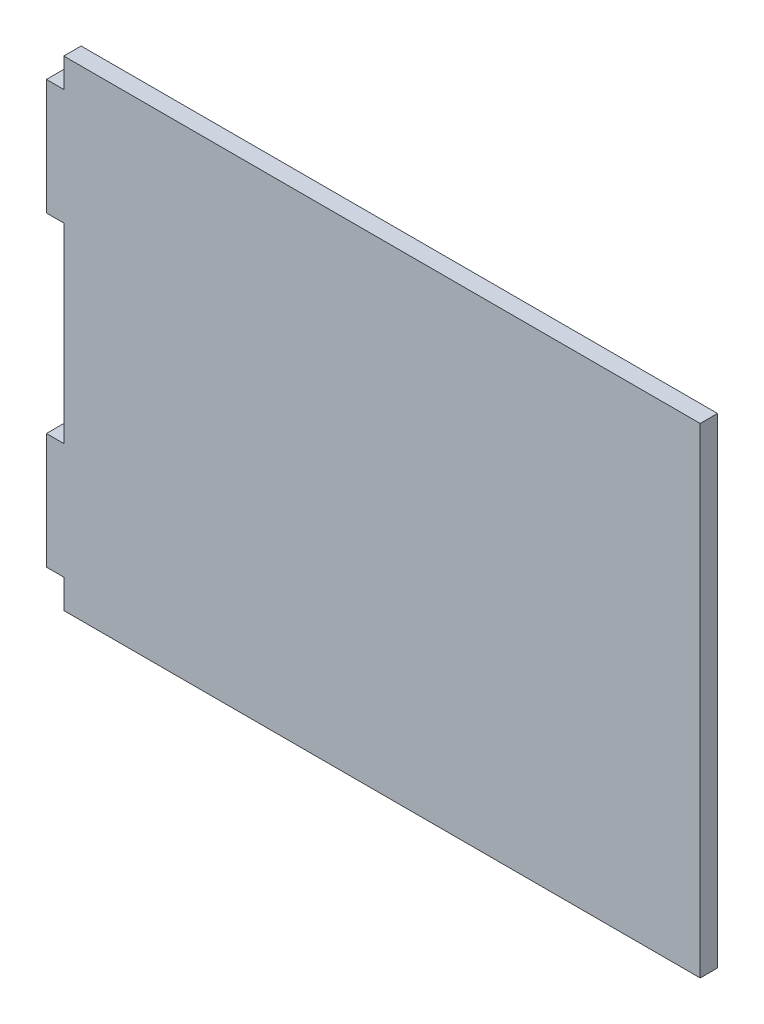
ISO-10303-21;
HEADER;
FILE_DESCRIPTION(('STEP AP214'),'2;1');
FILE_NAME('part.step','',(''),(''),'','','');
FILE_SCHEMA(('AUTOMOTIVE_DESIGN { 1 0 10303 214 1 1 1 1 }'));
ENDSEC;
DATA;
#1=APPLICATION_CONTEXT('core data for automotive mechanical design processes');
#2=APPLICATION_PROTOCOL_DEFINITION('international standard','automotive_design',2000,#1);
#3=PRODUCT_CONTEXT('',#1,'mechanical');
#4=PRODUCT('Part','Part','',(#3));
#5=PRODUCT_RELATED_PRODUCT_CATEGORY('part','',(#4));
#6=PRODUCT_DEFINITION_FORMATION('','',#4);
#7=PRODUCT_DEFINITION_CONTEXT('part definition',#1,'design');
#8=PRODUCT_DEFINITION('design','',#6,#7);
#9=PRODUCT_DEFINITION_SHAPE('','',#8);
#10=(LENGTH_UNIT() NAMED_UNIT(*) SI_UNIT(.MILLI.,.METRE.));
#11=(NAMED_UNIT(*) PLANE_ANGLE_UNIT() SI_UNIT($,.RADIAN.));
#12=(NAMED_UNIT(*) SI_UNIT($,.STERADIAN.) SOLID_ANGLE_UNIT());
#13=UNCERTAINTY_MEASURE_WITH_UNIT(LENGTH_MEASURE(1.E-05),#10,'distance_accuracy_value','');
#14=(GEOMETRIC_REPRESENTATION_CONTEXT(3) GLOBAL_UNCERTAINTY_ASSIGNED_CONTEXT((#13)) GLOBAL_UNIT_ASSIGNED_CONTEXT((#10,
#11,#12)) REPRESENTATION_CONTEXT('',''));
#15=CARTESIAN_POINT('',(0.,0.,0.));
#16=DIRECTION('',(0.,0.,1.));
#17=DIRECTION('',(1.,0.,0.));
#18=AXIS2_PLACEMENT_3D('',#15,#16,#17);
#19=CARTESIAN_POINT('',(-55.3612060704944,32.239336492891,3.));
#20=DIRECTION('',(1.,0.,0.));
#21=DIRECTION('',(0.,0.,-1.));
#22=AXIS2_PLACEMENT_3D('',#19,#20,#21);
#23=PLANE('',#22);
#24=DIRECTION('',(0.,-1.,0.));
#25=VECTOR('',#24,1.);
#26=CARTESIAN_POINT('',(-55.3612060704944,32.239336492891,0.));
#27=LINE('',#26,#25);
#28=CARTESIAN_POINT('',(-55.3612060704944,32.239336492891,0.));
#29=VERTEX_POINT('',#28);
#30=CARTESIAN_POINT('',(-55.3612060704944,27.239336492891,0.));
#31=VERTEX_POINT('',#30);
#32=EDGE_CURVE('E153',#29,#31,#27,.T.);
#33=ORIENTED_EDGE('',*,*,#32,.T.);
#34=DIRECTION('',(0.,0.,-1.));
#35=VECTOR('',#34,1.);
#36=CARTESIAN_POINT('',(-55.3612060704944,27.239336492891,3.));
#37=LINE('',#36,#35);
#38=CARTESIAN_POINT('',(-55.3612060704944,27.239336492891,3.));
#39=VERTEX_POINT('',#38);
#40=EDGE_CURVE('E11',#39,#31,#37,.T.);
#41=ORIENTED_EDGE('',*,*,#40,.F.);
#42=DIRECTION('',(0.,-1.,0.));
#43=VECTOR('',#42,1.);
#44=CARTESIAN_POINT('',(-55.3612060704944,32.239336492891,3.));
#45=LINE('',#44,#43);
#46=CARTESIAN_POINT('',(-55.3612060704944,32.239336492891,3.));
#47=VERTEX_POINT('',#46);
#48=EDGE_CURVE('E175',#47,#39,#45,.T.);
#49=ORIENTED_EDGE('',*,*,#48,.F.);
#50=DIRECTION('',(0.,0.,-1.));
#51=VECTOR('',#50,1.);
#52=CARTESIAN_POINT('',(-55.3612060704944,32.239336492891,3.));
#53=LINE('',#52,#51);
#54=EDGE_CURVE('E149',#47,#29,#53,.T.);
#55=ORIENTED_EDGE('',*,*,#54,.T.);
#56=EDGE_LOOP('',(#33,#41,#49,#55));
#57=FACE_BOUND('',#56,.T.);
#58=ADVANCED_FACE('F33',(#57),#23,.F.);
#59=CARTESIAN_POINT('',(-55.3612060704944,27.239336492891,3.));
#60=DIRECTION('',(0.,-1.,0.));
#61=DIRECTION('',(0.,0.,-1.));
#62=AXIS2_PLACEMENT_3D('',#59,#60,#61);
#63=PLANE('',#62);
#64=DIRECTION('',(-1.,0.,0.));
#65=VECTOR('',#64,1.);
#66=CARTESIAN_POINT('',(-55.3612060704944,27.239336492891,0.));
#67=LINE('',#66,#65);
#68=CARTESIAN_POINT('',(-58.3612060704944,27.239336492891,0.));
#69=VERTEX_POINT('',#68);
#70=EDGE_CURVE('E156',#31,#69,#67,.T.);
#71=ORIENTED_EDGE('',*,*,#70,.T.);
#72=DIRECTION('',(0.,0.,-1.));
#73=VECTOR('',#72,1.);
#74=CARTESIAN_POINT('',(-58.3612060704944,27.239336492891,3.));
#75=LINE('',#74,#73);
#76=CARTESIAN_POINT('',(-58.3612060704944,27.239336492891,3.));
#77=VERTEX_POINT('',#76);
#78=EDGE_CURVE('E41',#77,#69,#75,.T.);
#79=ORIENTED_EDGE('',*,*,#78,.F.);
#80=DIRECTION('',(-1.,0.,0.));
#81=VECTOR('',#80,1.);
#82=CARTESIAN_POINT('',(-55.3612060704944,27.239336492891,3.));
#83=LINE('',#82,#81);
#84=EDGE_CURVE('E104',#39,#77,#83,.T.);
#85=ORIENTED_EDGE('',*,*,#84,.F.);
#86=ORIENTED_EDGE('',*,*,#40,.T.);
#87=EDGE_LOOP('',(#71,#79,#85,#86));
#88=FACE_BOUND('',#87,.T.);
#89=ADVANCED_FACE('F253',(#88),#63,.F.);
#90=CARTESIAN_POINT('',(-58.3612060704944,7.23933649289099,3.));
#91=DIRECTION('',(1.,0.,0.));
#92=DIRECTION('',(0.,0.,-1.));
#93=AXIS2_PLACEMENT_3D('',#90,#91,#92);
#94=PLANE('',#93);
#95=DIRECTION('',(0.,-1.,0.));
#96=VECTOR('',#95,1.);
#97=CARTESIAN_POINT('',(-58.3612060704944,7.23933649289099,0.));
#98=LINE('',#97,#96);
#99=CARTESIAN_POINT('',(-58.3612060704944,7.23933649289099,0.));
#100=VERTEX_POINT('',#99);
#101=EDGE_CURVE('E158',#69,#100,#98,.T.);
#102=ORIENTED_EDGE('',*,*,#101,.T.);
#103=DIRECTION('',(0.,0.,-1.));
#104=VECTOR('',#103,1.);
#105=CARTESIAN_POINT('',(-58.3612060704944,7.23933649289099,3.));
#106=LINE('',#105,#104);
#107=CARTESIAN_POINT('',(-58.3612060704944,7.23933649289099,3.));
#108=VERTEX_POINT('',#107);
#109=EDGE_CURVE('E194',#108,#100,#106,.T.);
#110=ORIENTED_EDGE('',*,*,#109,.F.);
#111=DIRECTION('',(0.,-1.,0.));
#112=VECTOR('',#111,1.);
#113=CARTESIAN_POINT('',(-58.3612060704944,7.23933649289099,3.));
#114=LINE('',#113,#112);
#115=EDGE_CURVE('E202',#77,#108,#114,.T.);
#116=ORIENTED_EDGE('',*,*,#115,.F.);
#117=ORIENTED_EDGE('',*,*,#78,.T.);
#118=EDGE_LOOP('',(#102,#110,#116,#117));
#119=FACE_BOUND('',#118,.T.);
#120=ADVANCED_FACE('F200',(#119),#94,.F.);
#121=CARTESIAN_POINT('',(-55.3612060704944,7.23933649289099,3.));
#122=DIRECTION('',(0.,1.,0.));
#123=DIRECTION('',(0.,0.,1.));
#124=AXIS2_PLACEMENT_3D('',#121,#122,#123);
#125=PLANE('',#124);
#126=DIRECTION('',(1.,0.,0.));
#127=VECTOR('',#126,1.);
#128=CARTESIAN_POINT('',(-55.3612060704944,7.23933649289099,0.));
#129=LINE('',#128,#127);
#130=CARTESIAN_POINT('',(-55.3612060704944,7.23933649289099,0.));
#131=VERTEX_POINT('',#130);
#132=EDGE_CURVE('E160',#100,#131,#129,.T.);
#133=ORIENTED_EDGE('',*,*,#132,.T.);
#134=DIRECTION('',(0.,0.,-1.));
#135=VECTOR('',#134,1.);
#136=CARTESIAN_POINT('',(-55.3612060704944,7.23933649289099,3.));
#137=LINE('',#136,#135);
#138=CARTESIAN_POINT('',(-55.3612060704944,7.23933649289099,3.));
#139=VERTEX_POINT('',#138);
#140=EDGE_CURVE('E191',#139,#131,#137,.T.);
#141=ORIENTED_EDGE('',*,*,#140,.F.);
#142=DIRECTION('',(1.,0.,0.));
#143=VECTOR('',#142,1.);
#144=CARTESIAN_POINT('',(-55.3612060704944,7.23933649289099,3.));
#145=LINE('',#144,#143);
#146=EDGE_CURVE('E220',#108,#139,#145,.T.);
#147=ORIENTED_EDGE('',*,*,#146,.F.);
#148=ORIENTED_EDGE('',*,*,#109,.T.);
#149=EDGE_LOOP('',(#133,#141,#147,#148));
#150=FACE_BOUND('',#149,.T.);
#151=ADVANCED_FACE('F211',(#150),#125,.F.);
#152=CARTESIAN_POINT('',(-55.3612060704944,7.23933649289099,3.));
#153=DIRECTION('',(1.,0.,0.));
#154=DIRECTION('',(0.,1.,0.));
#155=AXIS2_PLACEMENT_3D('',#152,#153,#154);
#156=PLANE('',#155);
#157=DIRECTION('',(0.,-1.,0.));
#158=VECTOR('',#157,1.);
#159=CARTESIAN_POINT('',(-55.3612060704944,7.23933649289099,0.));
#160=LINE('',#159,#158);
#161=CARTESIAN_POINT('',(-55.3612060704944,-25.760663507109,0.));
#162=VERTEX_POINT('',#161);
#163=EDGE_CURVE('E162',#131,#162,#160,.T.);
#164=ORIENTED_EDGE('',*,*,#163,.T.);
#165=DIRECTION('',(0.,0.,-1.));
#166=VECTOR('',#165,1.);
#167=CARTESIAN_POINT('',(-55.3612060704944,-25.760663507109,3.));
#168=LINE('',#167,#166);
#169=CARTESIAN_POINT('',(-55.3612060704944,-25.760663507109,3.));
#170=VERTEX_POINT('',#169);
#171=EDGE_CURVE('E188',#170,#162,#168,.T.);
#172=ORIENTED_EDGE('',*,*,#171,.F.);
#173=DIRECTION('',(0.,-1.,0.));
#174=VECTOR('',#173,1.);
#175=CARTESIAN_POINT('',(-55.3612060704944,7.23933649289099,3.));
#176=LINE('',#175,#174);
#177=EDGE_CURVE('E217',#139,#170,#176,.T.);
#178=ORIENTED_EDGE('',*,*,#177,.F.);
#179=ORIENTED_EDGE('',*,*,#140,.T.);
#180=EDGE_LOOP('',(#164,#172,#178,#179));
#181=FACE_BOUND('',#180,.T.);
#182=ADVANCED_FACE('F215',(#181),#156,.F.);
#183=CARTESIAN_POINT('',(-55.3612060704944,-25.760663507109,3.));
#184=DIRECTION('',(0.,-1.,0.));
#185=DIRECTION('',(0.,0.,-1.));
#186=AXIS2_PLACEMENT_3D('',#183,#184,#185);
#187=PLANE('',#186);
#188=DIRECTION('',(-1.,0.,0.));
#189=VECTOR('',#188,1.);
#190=CARTESIAN_POINT('',(-55.3612060704944,-25.760663507109,0.));
#191=LINE('',#190,#189);
#192=CARTESIAN_POINT('',(-58.3612060704944,-25.760663507109,0.));
#193=VERTEX_POINT('',#192);
#194=EDGE_CURVE('E164',#162,#193,#191,.T.);
#195=ORIENTED_EDGE('',*,*,#194,.T.);
#196=DIRECTION('',(0.,0.,-1.));
#197=VECTOR('',#196,1.);
#198=CARTESIAN_POINT('',(-58.3612060704944,-25.760663507109,3.));
#199=LINE('',#198,#197);
#200=CARTESIAN_POINT('',(-58.3612060704944,-25.760663507109,3.));
#201=VERTEX_POINT('',#200);
#202=EDGE_CURVE('E185',#201,#193,#199,.T.);
#203=ORIENTED_EDGE('',*,*,#202,.F.);
#204=DIRECTION('',(-1.,0.,0.));
#205=VECTOR('',#204,1.);
#206=CARTESIAN_POINT('',(-55.3612060704944,-25.760663507109,3.));
#207=LINE('',#206,#205);
#208=EDGE_CURVE('E219',#170,#201,#207,.T.);
#209=ORIENTED_EDGE('',*,*,#208,.F.);
#210=ORIENTED_EDGE('',*,*,#171,.T.);
#211=EDGE_LOOP('',(#195,#203,#209,#210));
#212=FACE_BOUND('',#211,.T.);
#213=ADVANCED_FACE('F266',(#212),#187,.F.);
#214=CARTESIAN_POINT('',(-58.3612060704944,-45.760663507109,3.));
#215=DIRECTION('',(1.,0.,0.));
#216=DIRECTION('',(0.,0.,-1.));
#217=AXIS2_PLACEMENT_3D('',#214,#215,#216);
#218=PLANE('',#217);
#219=DIRECTION('',(0.,-1.,0.));
#220=VECTOR('',#219,1.);
#221=CARTESIAN_POINT('',(-58.3612060704944,-45.760663507109,0.));
#222=LINE('',#221,#220);
#223=CARTESIAN_POINT('',(-58.3612060704944,-45.760663507109,0.));
#224=VERTEX_POINT('',#223);
#225=EDGE_CURVE('E166',#193,#224,#222,.T.);
#226=ORIENTED_EDGE('',*,*,#225,.T.);
#227=DIRECTION('',(0.,0.,-1.));
#228=VECTOR('',#227,1.);
#229=CARTESIAN_POINT('',(-58.3612060704944,-45.760663507109,3.));
#230=LINE('',#229,#228);
#231=CARTESIAN_POINT('',(-58.3612060704944,-45.760663507109,3.));
#232=VERTEX_POINT('',#231);
#233=EDGE_CURVE('E182',#232,#224,#230,.T.);
#234=ORIENTED_EDGE('',*,*,#233,.F.);
#235=DIRECTION('',(0.,-1.,0.));
#236=VECTOR('',#235,1.);
#237=CARTESIAN_POINT('',(-58.3612060704944,-45.760663507109,3.));
#238=LINE('',#237,#236);
#239=EDGE_CURVE('E222',#201,#232,#238,.T.);
#240=ORIENTED_EDGE('',*,*,#239,.F.);
#241=ORIENTED_EDGE('',*,*,#202,.T.);
#242=EDGE_LOOP('',(#226,#234,#240,#241));
#243=FACE_BOUND('',#242,.T.);
#244=ADVANCED_FACE('F269',(#243),#218,.F.);
#245=CARTESIAN_POINT('',(-55.3612060704944,-45.760663507109,3.));
#246=DIRECTION('',(0.,1.,0.));
#247=DIRECTION('',(0.,0.,1.));
#248=AXIS2_PLACEMENT_3D('',#245,#246,#247);
#249=PLANE('',#248);
#250=DIRECTION('',(1.,0.,0.));
#251=VECTOR('',#250,1.);
#252=CARTESIAN_POINT('',(-55.3612060704944,-45.760663507109,0.));
#253=LINE('',#252,#251);
#254=CARTESIAN_POINT('',(-55.3612060704944,-45.760663507109,0.));
#255=VERTEX_POINT('',#254);
#256=EDGE_CURVE('E168',#224,#255,#253,.T.);
#257=ORIENTED_EDGE('',*,*,#256,.T.);
#258=DIRECTION('',(0.,0.,-1.));
#259=VECTOR('',#258,1.);
#260=CARTESIAN_POINT('',(-55.3612060704944,-45.760663507109,3.));
#261=LINE('',#260,#259);
#262=CARTESIAN_POINT('',(-55.3612060704944,-45.760663507109,3.));
#263=VERTEX_POINT('',#262);
#264=EDGE_CURVE('E179',#263,#255,#261,.T.);
#265=ORIENTED_EDGE('',*,*,#264,.F.);
#266=DIRECTION('',(1.,0.,0.));
#267=VECTOR('',#266,1.);
#268=CARTESIAN_POINT('',(-55.3612060704944,-45.760663507109,3.));
#269=LINE('',#268,#267);
#270=EDGE_CURVE('E228',#232,#263,#269,.T.);
#271=ORIENTED_EDGE('',*,*,#270,.F.);
#272=ORIENTED_EDGE('',*,*,#233,.T.);
#273=EDGE_LOOP('',(#257,#265,#271,#272));
#274=FACE_BOUND('',#273,.T.);
#275=ADVANCED_FACE('F234',(#274),#249,.F.);
#276=CARTESIAN_POINT('',(-55.3612060704944,-45.760663507109,3.));
#277=DIRECTION('',(1.,0.,0.));
#278=DIRECTION('',(0.,1.,0.));
#279=AXIS2_PLACEMENT_3D('',#276,#277,#278);
#280=PLANE('',#279);
#281=DIRECTION('',(0.,-1.,0.));
#282=VECTOR('',#281,1.);
#283=CARTESIAN_POINT('',(-55.3612060704944,-45.760663507109,0.));
#284=LINE('',#283,#282);
#285=CARTESIAN_POINT('',(-55.3612060704944,-50.760663507109,0.));
#286=VERTEX_POINT('',#285);
#287=EDGE_CURVE('E170',#255,#286,#284,.T.);
#288=ORIENTED_EDGE('',*,*,#287,.T.);
#289=DIRECTION('',(0.,0.,-1.));
#290=VECTOR('',#289,1.);
#291=CARTESIAN_POINT('',(-55.3612060704944,-50.760663507109,3.));
#292=LINE('',#291,#290);
#293=CARTESIAN_POINT('',(-55.3612060704944,-50.760663507109,3.));
#294=VERTEX_POINT('',#293);
#295=EDGE_CURVE('E144',#294,#286,#292,.T.);
#296=ORIENTED_EDGE('',*,*,#295,.F.);
#297=DIRECTION('',(0.,-1.,0.));
#298=VECTOR('',#297,1.);
#299=CARTESIAN_POINT('',(-55.3612060704944,-45.760663507109,3.));
#300=LINE('',#299,#298);
#301=EDGE_CURVE('E135',#263,#294,#300,.T.);
#302=ORIENTED_EDGE('',*,*,#301,.F.);
#303=ORIENTED_EDGE('',*,*,#264,.T.);
#304=EDGE_LOOP('',(#288,#296,#302,#303));
#305=FACE_BOUND('',#304,.T.);
#306=ADVANCED_FACE('F238',(#305),#280,.F.);
#307=CARTESIAN_POINT('',(-55.3612060704944,-50.760663507109,3.));
#308=DIRECTION('',(0.,1.,0.));
#309=DIRECTION('',(0.,0.,1.));
#310=AXIS2_PLACEMENT_3D('',#307,#308,#309);
#311=PLANE('',#310);
#312=DIRECTION('',(1.,0.,0.));
#313=VECTOR('',#312,1.);
#314=CARTESIAN_POINT('',(-55.3612060704944,-50.760663507109,0.));
#315=LINE('',#314,#313);
#316=CARTESIAN_POINT('',(54.6387939295056,-50.760663507109,0.));
#317=VERTEX_POINT('',#316);
#318=EDGE_CURVE('E143',#286,#317,#315,.T.);
#319=ORIENTED_EDGE('',*,*,#318,.T.);
#320=DIRECTION('',(0.,0.,-1.));
#321=VECTOR('',#320,1.);
#322=CARTESIAN_POINT('',(54.6387939295056,-50.760663507109,3.));
#323=LINE('',#322,#321);
#324=CARTESIAN_POINT('',(54.6387939295056,-50.760663507109,3.));
#325=VERTEX_POINT('',#324);
#326=EDGE_CURVE('E140',#325,#317,#323,.T.);
#327=ORIENTED_EDGE('',*,*,#326,.F.);
#328=DIRECTION('',(1.,0.,0.));
#329=VECTOR('',#328,1.);
#330=CARTESIAN_POINT('',(-55.3612060704944,-50.760663507109,3.));
#331=LINE('',#330,#329);
#332=EDGE_CURVE('E129',#294,#325,#331,.T.);
#333=ORIENTED_EDGE('',*,*,#332,.F.);
#334=ORIENTED_EDGE('',*,*,#295,.T.);
#335=EDGE_LOOP('',(#319,#327,#333,#334));
#336=FACE_BOUND('',#335,.T.);
#337=ADVANCED_FACE('F141',(#336),#311,.F.);
#338=CARTESIAN_POINT('',(54.6387939295056,32.239336492891,3.));
#339=DIRECTION('',(-1.,0.,0.));
#340=DIRECTION('',(0.,0.,1.));
#341=AXIS2_PLACEMENT_3D('',#338,#339,#340);
#342=PLANE('',#341);
#343=DIRECTION('',(0.,1.,0.));
#344=VECTOR('',#343,1.);
#345=CARTESIAN_POINT('',(54.6387939295056,32.239336492891,0.));
#346=LINE('',#345,#344);
#347=CARTESIAN_POINT('',(54.6387939295056,32.239336492891,0.));
#348=VERTEX_POINT('',#347);
#349=EDGE_CURVE('E90',#317,#348,#346,.T.);
#350=ORIENTED_EDGE('',*,*,#349,.T.);
#351=DIRECTION('',(0.,0.,-1.));
#352=VECTOR('',#351,1.);
#353=CARTESIAN_POINT('',(54.6387939295056,32.239336492891,3.));
#354=LINE('',#353,#352);
#355=CARTESIAN_POINT('',(54.6387939295056,32.239336492891,3.));
#356=VERTEX_POINT('',#355);
#357=EDGE_CURVE('E145',#356,#348,#354,.T.);
#358=ORIENTED_EDGE('',*,*,#357,.F.);
#359=DIRECTION('',(0.,1.,0.));
#360=VECTOR('',#359,1.);
#361=CARTESIAN_POINT('',(54.6387939295056,32.239336492891,3.));
#362=LINE('',#361,#360);
#363=EDGE_CURVE('E133',#325,#356,#362,.T.);
#364=ORIENTED_EDGE('',*,*,#363,.F.);
#365=ORIENTED_EDGE('',*,*,#326,.T.);
#366=EDGE_LOOP('',(#350,#358,#364,#365));
#367=FACE_BOUND('',#366,.T.);
#368=ADVANCED_FACE('F147',(#367),#342,.F.);
#369=CARTESIAN_POINT('',(-55.3612060704944,32.239336492891,3.));
#370=DIRECTION('',(0.,-1.,0.));
#371=DIRECTION('',(0.,0.,-1.));
#372=AXIS2_PLACEMENT_3D('',#369,#370,#371);
#373=PLANE('',#372);
#374=DIRECTION('',(-1.,0.,0.));
#375=VECTOR('',#374,1.);
#376=CARTESIAN_POINT('',(-55.3612060704944,32.239336492891,0.));
#377=LINE('',#376,#375);
#378=EDGE_CURVE('E96',#348,#29,#377,.T.);
#379=ORIENTED_EDGE('',*,*,#378,.T.);
#380=ORIENTED_EDGE('',*,*,#54,.F.);
#381=DIRECTION('',(-1.,0.,0.));
#382=VECTOR('',#381,1.);
#383=CARTESIAN_POINT('',(-55.3612060704944,32.239336492891,3.));
#384=LINE('',#383,#382);
#385=EDGE_CURVE('E49',#356,#47,#384,.T.);
#386=ORIENTED_EDGE('',*,*,#385,.F.);
#387=ORIENTED_EDGE('',*,*,#357,.T.);
#388=EDGE_LOOP('',(#379,#380,#386,#387));
#389=FACE_BOUND('',#388,.T.);
#390=ADVANCED_FACE('F242',(#389),#373,.F.);
#391=CARTESIAN_POINT('',(0.,0.,3.));
#392=DIRECTION('',(0.,0.,-1.));
#393=DIRECTION('',(-1.,0.,0.));
#394=AXIS2_PLACEMENT_3D('',#391,#392,#393);
#395=PLANE('',#394);
#396=ORIENTED_EDGE('',*,*,#48,.T.);
#397=ORIENTED_EDGE('',*,*,#84,.T.);
#398=ORIENTED_EDGE('',*,*,#115,.T.);
#399=ORIENTED_EDGE('',*,*,#146,.T.);
#400=ORIENTED_EDGE('',*,*,#177,.T.);
#401=ORIENTED_EDGE('',*,*,#208,.T.);
#402=ORIENTED_EDGE('',*,*,#239,.T.);
#403=ORIENTED_EDGE('',*,*,#270,.T.);
#404=ORIENTED_EDGE('',*,*,#301,.T.);
#405=ORIENTED_EDGE('',*,*,#332,.T.);
#406=ORIENTED_EDGE('',*,*,#363,.T.);
#407=ORIENTED_EDGE('',*,*,#385,.T.);
#408=EDGE_LOOP('',(#396,#397,#398,#399,#400,#401,#402,#403,#404,#405,#406,#407));
#409=FACE_BOUND('',#408,.T.);
#410=ADVANCED_FACE('F131',(#409),#395,.F.);
#411=CARTESIAN_POINT('',(0.,0.,0.));
#412=DIRECTION('',(0.,0.,-1.));
#413=DIRECTION('',(-1.,0.,0.));
#414=AXIS2_PLACEMENT_3D('',#411,#412,#413);
#415=PLANE('',#414);
#416=ORIENTED_EDGE('',*,*,#32,.F.);
#417=ORIENTED_EDGE('',*,*,#378,.F.);
#418=ORIENTED_EDGE('',*,*,#349,.F.);
#419=ORIENTED_EDGE('',*,*,#318,.F.);
#420=ORIENTED_EDGE('',*,*,#287,.F.);
#421=ORIENTED_EDGE('',*,*,#256,.F.);
#422=ORIENTED_EDGE('',*,*,#225,.F.);
#423=ORIENTED_EDGE('',*,*,#194,.F.);
#424=ORIENTED_EDGE('',*,*,#163,.F.);
#425=ORIENTED_EDGE('',*,*,#132,.F.);
#426=ORIENTED_EDGE('',*,*,#101,.F.);
#427=ORIENTED_EDGE('',*,*,#70,.F.);
#428=EDGE_LOOP('',(#416,#417,#418,#419,#420,#421,#422,#423,#424,#425,#426,#427));
#429=FACE_BOUND('',#428,.T.);
#430=ADVANCED_FACE('F206',(#429),#415,.T.);
#431=CLOSED_SHELL('',(#58,#89,#120,#151,#182,#213,#244,#275,#306,#337,#368,#390,#410,#430));
#432=MANIFOLD_SOLID_BREP('B2',#431);
#433=ADVANCED_BREP_SHAPE_REPRESENTATION('',(#18,#432),#14);
#434=SHAPE_DEFINITION_REPRESENTATION(#9,#433);
ENDSEC;
END-ISO-10303-21;
